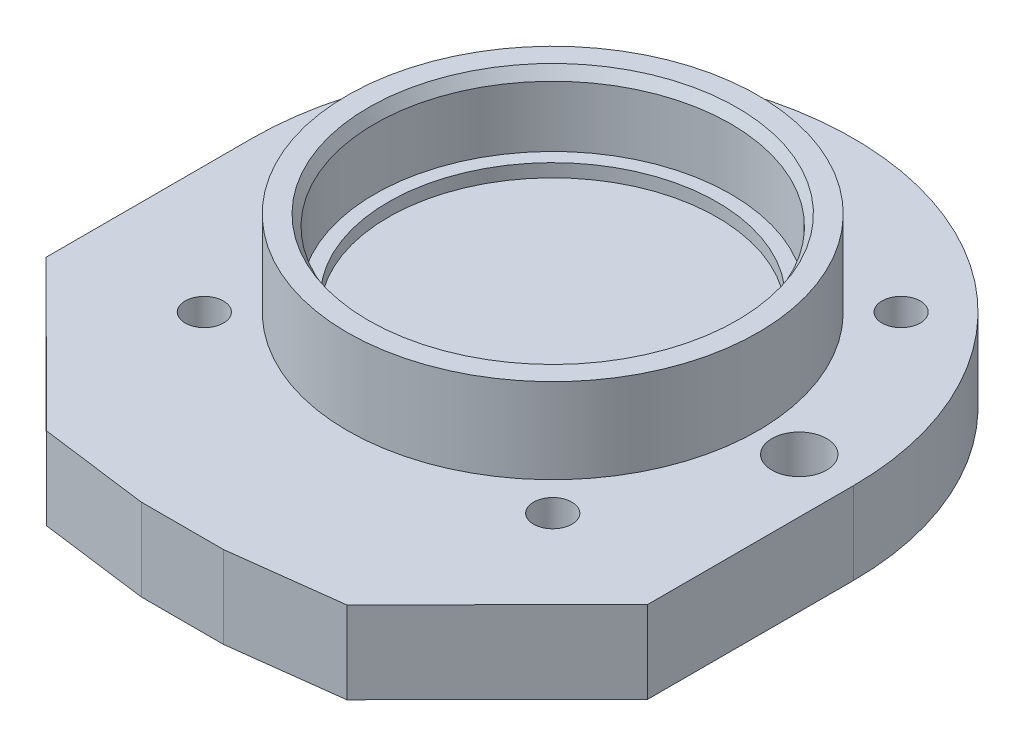
ISO-10303-21;
HEADER;
FILE_DESCRIPTION(('STEP AP214'),'2;1');
FILE_NAME('part.step','',(''),(''),'','','');
FILE_SCHEMA(('AUTOMOTIVE_DESIGN { 1 0 10303 214 1 1 1 1 }'));
ENDSEC;
DATA;
#1=APPLICATION_CONTEXT('core data for automotive mechanical design processes');
#2=APPLICATION_PROTOCOL_DEFINITION('international standard','automotive_design',2000,#1);
#3=PRODUCT_CONTEXT('',#1,'mechanical');
#4=PRODUCT('Part','Part','',(#3));
#5=PRODUCT_RELATED_PRODUCT_CATEGORY('part','',(#4));
#6=PRODUCT_DEFINITION_FORMATION('','',#4);
#7=PRODUCT_DEFINITION_CONTEXT('part definition',#1,'design');
#8=PRODUCT_DEFINITION('design','',#6,#7);
#9=PRODUCT_DEFINITION_SHAPE('','',#8);
#10=(LENGTH_UNIT() NAMED_UNIT(*) SI_UNIT(.MILLI.,.METRE.));
#11=(NAMED_UNIT(*) PLANE_ANGLE_UNIT() SI_UNIT($,.RADIAN.));
#12=(NAMED_UNIT(*) SI_UNIT($,.STERADIAN.) SOLID_ANGLE_UNIT());
#13=UNCERTAINTY_MEASURE_WITH_UNIT(LENGTH_MEASURE(1.E-05),#10,'distance_accuracy_value','');
#14=(GEOMETRIC_REPRESENTATION_CONTEXT(3) GLOBAL_UNCERTAINTY_ASSIGNED_CONTEXT((#13)) GLOBAL_UNIT_ASSIGNED_CONTEXT((#10,
#11,#12)) REPRESENTATION_CONTEXT('',''));
#15=CARTESIAN_POINT('',(0.,0.,0.));
#16=DIRECTION('',(0.,0.,1.));
#17=DIRECTION('',(1.,0.,0.));
#18=AXIS2_PLACEMENT_3D('',#15,#16,#17);
#19=CARTESIAN_POINT('',(0.,30.,0.));
#20=DIRECTION('',(0.,1.,0.));
#21=DIRECTION('',(0.,0.,1.00000000000001));
#22=AXIS2_PLACEMENT_3D('',#19,#20,#21);
#23=PLANE('',#22);
#24=CARTESIAN_POINT('',(0.,30.,0.));
#25=DIRECTION('',(0.,1.,0.));
#26=DIRECTION('',(0.,0.,1.00000000000001));
#27=AXIS2_PLACEMENT_3D('',#24,#25,#26);
#28=CIRCLE('',#27,60.);
#29=CARTESIAN_POINT('',(0.,30.,60.0000000000004));
#30=VERTEX_POINT('',#29);
#31=EDGE_CURVE('E19',#30,#30,#28,.T.);
#32=ORIENTED_EDGE('',*,*,#31,.T.);
#33=EDGE_LOOP('',(#32));
#34=FACE_BOUND('',#33,.T.);
#35=ADVANCED_FACE('F16',(#34),#23,.T.);
#36=CARTESIAN_POINT('',(0.,34.8,0.));
#37=DIRECTION('',(0.,1.,0.));
#38=DIRECTION('',(0.,0.,1.00000000000001));
#39=AXIS2_PLACEMENT_3D('',#36,#37,#38);
#40=CYLINDRICAL_SURFACE('',#39,60.);
#41=ORIENTED_EDGE('',*,*,#31,.F.);
#42=EDGE_LOOP('',(#41));
#43=FACE_BOUND('',#42,.T.);
#44=CARTESIAN_POINT('',(0.,34.8,0.));
#45=DIRECTION('',(0.,1.,0.));
#46=DIRECTION('',(0.,0.,1.00000000000001));
#47=AXIS2_PLACEMENT_3D('',#44,#45,#46);
#48=CIRCLE('',#47,60.);
#49=CARTESIAN_POINT('',(0.,34.8,60.0000000000004));
#50=VERTEX_POINT('',#49);
#51=EDGE_CURVE('E204',#50,#50,#48,.F.);
#52=ORIENTED_EDGE('',*,*,#51,.F.);
#53=EDGE_LOOP('',(#52));
#54=FACE_BOUND('',#53,.T.);
#55=ADVANCED_FACE('F212',(#43,#54),#40,.F.);
#56=CARTESIAN_POINT('',(0.,34.8,0.));
#57=DIRECTION('',(0.,1.,0.));
#58=DIRECTION('',(0.,0.,1.00000000000001));
#59=AXIS2_PLACEMENT_3D('',#56,#57,#58);
#60=PLANE('',#59);
#61=ORIENTED_EDGE('',*,*,#51,.T.);
#62=EDGE_LOOP('',(#61));
#63=FACE_BOUND('',#62,.T.);
#64=CARTESIAN_POINT('',(0.,34.8,0.));
#65=DIRECTION('',(0.,1.,0.));
#66=DIRECTION('',(0.,0.,1.00000000000001));
#67=AXIS2_PLACEMENT_3D('',#64,#65,#66);
#68=CIRCLE('',#67,65.);
#69=CARTESIAN_POINT('',(0.,34.8,65.0000000000005));
#70=VERTEX_POINT('',#69);
#71=EDGE_CURVE('E202',#70,#70,#68,.T.);
#72=ORIENTED_EDGE('',*,*,#71,.T.);
#73=EDGE_LOOP('',(#72));
#74=FACE_BOUND('',#73,.T.);
#75=ADVANCED_FACE('F215',(#63,#74),#60,.T.);
#76=CARTESIAN_POINT('',(0.,61.,0.));
#77=DIRECTION('',(0.,1.,0.));
#78=DIRECTION('',(0.,0.,1.00000000000001));
#79=AXIS2_PLACEMENT_3D('',#76,#77,#78);
#80=CYLINDRICAL_SURFACE('',#79,65.);
#81=ORIENTED_EDGE('',*,*,#71,.F.);
#82=EDGE_LOOP('',(#81));
#83=FACE_BOUND('',#82,.T.);
#84=CARTESIAN_POINT('',(4.9960036108132E-13,56.999925434073,0.));
#85=DIRECTION('',(0.,1.,0.));
#86=DIRECTION('',(0.,0.,1.00000000000001));
#87=AXIS2_PLACEMENT_3D('',#84,#85,#86);
#88=CIRCLE('',#87,65.);
#89=CARTESIAN_POINT('',(4.99663786908411E-13,56.999925434073,65.0000000000004));
#90=VERTEX_POINT('',#89);
#91=EDGE_CURVE('E199',#90,#90,#88,.T.);
#92=ORIENTED_EDGE('',*,*,#91,.T.);
#93=EDGE_LOOP('',(#92));
#94=FACE_BOUND('',#93,.T.);
#95=ADVANCED_FACE('F221',(#83,#94),#80,.F.);
#96=CARTESIAN_POINT('',(4.9960036108132E-13,60.9999806962001,0.));
#97=DIRECTION('',(0.,1.,0.));
#98=DIRECTION('',(0.,0.,1.00000000000001));
#99=AXIS2_PLACEMENT_3D('',#96,#97,#98);
#100=CONICAL_SURFACE('',#99,67.3094345119396,0.523599062390001);
#101=ORIENTED_EDGE('',*,*,#91,.F.);
#102=EDGE_LOOP('',(#101));
#103=FACE_BOUND('',#102,.T.);
#104=CARTESIAN_POINT('',(4.9960036108132E-13,61.,0.));
#105=DIRECTION('',(0.,1.,0.));
#106=DIRECTION('',(0.,0.,1.00000000000001));
#107=AXIS2_PLACEMENT_3D('',#104,#105,#106);
#108=CIRCLE('',#107,67.309445657001);
#109=CARTESIAN_POINT('',(4.99666040423809E-13,61.,67.3094456570014));
#110=VERTEX_POINT('',#109);
#111=EDGE_CURVE('E196',#110,#110,#108,.F.);
#112=ORIENTED_EDGE('',*,*,#111,.F.);
#113=EDGE_LOOP('',(#112));
#114=FACE_BOUND('',#113,.T.);
#115=ADVANCED_FACE('F321',(#103,#114),#100,.F.);
#116=CARTESIAN_POINT('',(0.,61.,0.));
#117=DIRECTION('',(0.,1.,0.));
#118=DIRECTION('',(0.,0.,1.00000000000001));
#119=AXIS2_PLACEMENT_3D('',#116,#117,#118);
#120=PLANE('',#119);
#121=ORIENTED_EDGE('',*,*,#111,.T.);
#122=EDGE_LOOP('',(#121));
#123=FACE_BOUND('',#122,.T.);
#124=CARTESIAN_POINT('',(0.,61.,0.));
#125=DIRECTION('',(0.,1.,0.));
#126=DIRECTION('',(0.,0.,1.00000000000001));
#127=AXIS2_PLACEMENT_3D('',#124,#125,#126);
#128=CIRCLE('',#127,75.);
#129=CARTESIAN_POINT('',(0.,61.,75.0000000000006));
#130=VERTEX_POINT('',#129);
#131=EDGE_CURVE('E193',#130,#130,#128,.F.);
#132=ORIENTED_EDGE('',*,*,#131,.F.);
#133=EDGE_LOOP('',(#132));
#134=FACE_BOUND('',#133,.T.);
#135=ADVANCED_FACE('F317',(#123,#134),#120,.T.);
#136=CARTESIAN_POINT('',(0.,30.,0.));
#137=DIRECTION('',(0.,1.,0.));
#138=DIRECTION('',(0.,0.,1.00000000000001));
#139=AXIS2_PLACEMENT_3D('',#136,#137,#138);
#140=CYLINDRICAL_SURFACE('',#139,75.);
#141=ORIENTED_EDGE('',*,*,#131,.T.);
#142=EDGE_LOOP('',(#141));
#143=FACE_BOUND('',#142,.T.);
#144=CARTESIAN_POINT('',(0.,30.,0.));
#145=DIRECTION('',(0.,1.,0.));
#146=DIRECTION('',(0.,0.,1.00000000000001));
#147=AXIS2_PLACEMENT_3D('',#144,#145,#146);
#148=CIRCLE('',#147,75.);
#149=CARTESIAN_POINT('',(0.,30.,75.0000000000006));
#150=VERTEX_POINT('',#149);
#151=EDGE_CURVE('E178',#150,#150,#148,.F.);
#152=ORIENTED_EDGE('',*,*,#151,.F.);
#153=EDGE_LOOP('',(#152));
#154=FACE_BOUND('',#153,.T.);
#155=ADVANCED_FACE('F313',(#143,#154),#140,.T.);
#156=CARTESIAN_POINT('',(-63.5999999999999,16.,-63.5999999999997));
#157=DIRECTION('',(0.,-1.,0.));
#158=DIRECTION('',(0.,0.,-1.00000000000001));
#159=AXIS2_PLACEMENT_3D('',#156,#157,#158);
#160=CYLINDRICAL_SURFACE('',#159,7.);
#161=CARTESIAN_POINT('',(-63.5999999999999,16.,-63.5999999999997));
#162=DIRECTION('',(0.,-1.,0.));
#163=DIRECTION('',(0.,0.,-1.00000000000001));
#164=AXIS2_PLACEMENT_3D('',#161,#162,#163);
#165=CIRCLE('',#164,7.);
#166=CARTESIAN_POINT('',(-63.5999999999999,16.,-70.5999999999998));
#167=VERTEX_POINT('',#166);
#168=EDGE_CURVE('E190',#167,#167,#165,.F.);
#169=ORIENTED_EDGE('',*,*,#168,.F.);
#170=EDGE_LOOP('',(#169));
#171=FACE_BOUND('',#170,.T.);
#172=CARTESIAN_POINT('',(-63.5999999999999,30.,-63.5999999999997));
#173=DIRECTION('',(0.,-1.,0.));
#174=DIRECTION('',(0.,0.,-1.00000000000001));
#175=AXIS2_PLACEMENT_3D('',#172,#173,#174);
#176=CIRCLE('',#175,7.);
#177=CARTESIAN_POINT('',(-63.5999999999999,30.,-70.5999999999998));
#178=VERTEX_POINT('',#177);
#179=EDGE_CURVE('E175',#178,#178,#176,.T.);
#180=ORIENTED_EDGE('',*,*,#179,.F.);
#181=EDGE_LOOP('',(#180));
#182=FACE_BOUND('',#181,.T.);
#183=ADVANCED_FACE('F309',(#171,#182),#160,.F.);
#184=CARTESIAN_POINT('',(-63.5999999999999,16.,63.6));
#185=DIRECTION('',(0.,-1.,0.));
#186=DIRECTION('',(0.,0.,-1.00000000000001));
#187=AXIS2_PLACEMENT_3D('',#184,#185,#186);
#188=CYLINDRICAL_SURFACE('',#187,7.);
#189=CARTESIAN_POINT('',(-63.5999999999999,16.,63.6));
#190=DIRECTION('',(0.,-1.,0.));
#191=DIRECTION('',(0.,0.,-1.00000000000001));
#192=AXIS2_PLACEMENT_3D('',#189,#190,#191);
#193=CIRCLE('',#192,7.);
#194=CARTESIAN_POINT('',(-63.5999999999999,16.,56.5999999999999));
#195=VERTEX_POINT('',#194);
#196=EDGE_CURVE('E187',#195,#195,#193,.F.);
#197=ORIENTED_EDGE('',*,*,#196,.F.);
#198=EDGE_LOOP('',(#197));
#199=FACE_BOUND('',#198,.T.);
#200=CARTESIAN_POINT('',(-63.5999999999999,30.,63.6));
#201=DIRECTION('',(0.,-1.,0.));
#202=DIRECTION('',(0.,0.,-1.00000000000001));
#203=AXIS2_PLACEMENT_3D('',#200,#201,#202);
#204=CIRCLE('',#203,7.);
#205=CARTESIAN_POINT('',(-63.5999999999999,30.,56.5999999999999));
#206=VERTEX_POINT('',#205);
#207=EDGE_CURVE('E172',#206,#206,#204,.T.);
#208=ORIENTED_EDGE('',*,*,#207,.F.);
#209=EDGE_LOOP('',(#208));
#210=FACE_BOUND('',#209,.T.);
#211=ADVANCED_FACE('F305',(#199,#210),#188,.F.);
#212=CARTESIAN_POINT('',(63.5999999999999,16.,63.5999999999995));
#213=DIRECTION('',(0.,-1.,0.));
#214=DIRECTION('',(0.,0.,-1.00000000000001));
#215=AXIS2_PLACEMENT_3D('',#212,#213,#214);
#216=CYLINDRICAL_SURFACE('',#215,7.);
#217=CARTESIAN_POINT('',(63.5999999999999,16.,63.5999999999995));
#218=DIRECTION('',(0.,-1.,0.));
#219=DIRECTION('',(0.,0.,-1.00000000000001));
#220=AXIS2_PLACEMENT_3D('',#217,#218,#219);
#221=CIRCLE('',#220,7.);
#222=CARTESIAN_POINT('',(63.5999999999999,16.,56.5999999999994));
#223=VERTEX_POINT('',#222);
#224=EDGE_CURVE('E184',#223,#223,#221,.F.);
#225=ORIENTED_EDGE('',*,*,#224,.F.);
#226=EDGE_LOOP('',(#225));
#227=FACE_BOUND('',#226,.T.);
#228=CARTESIAN_POINT('',(63.5999999999999,30.,63.5999999999995));
#229=DIRECTION('',(0.,-1.,0.));
#230=DIRECTION('',(0.,0.,-1.00000000000001));
#231=AXIS2_PLACEMENT_3D('',#228,#229,#230);
#232=CIRCLE('',#231,7.);
#233=CARTESIAN_POINT('',(63.5999999999999,30.,56.5999999999994));
#234=VERTEX_POINT('',#233);
#235=EDGE_CURVE('E169',#234,#234,#232,.T.);
#236=ORIENTED_EDGE('',*,*,#235,.F.);
#237=EDGE_LOOP('',(#236));
#238=FACE_BOUND('',#237,.T.);
#239=ADVANCED_FACE('F301',(#227,#238),#216,.F.);
#240=CARTESIAN_POINT('',(63.6,16.,-63.6));
#241=DIRECTION('',(0.,-1.,0.));
#242=DIRECTION('',(0.,0.,-1.00000000000001));
#243=AXIS2_PLACEMENT_3D('',#240,#241,#242);
#244=CYLINDRICAL_SURFACE('',#243,7.);
#245=CARTESIAN_POINT('',(63.6,16.,-63.6));
#246=DIRECTION('',(0.,-1.,0.));
#247=DIRECTION('',(0.,0.,-1.00000000000001));
#248=AXIS2_PLACEMENT_3D('',#245,#246,#247);
#249=CIRCLE('',#248,7.);
#250=CARTESIAN_POINT('',(63.6,16.,-70.6));
#251=VERTEX_POINT('',#250);
#252=EDGE_CURVE('E181',#251,#251,#249,.F.);
#253=ORIENTED_EDGE('',*,*,#252,.F.);
#254=EDGE_LOOP('',(#253));
#255=FACE_BOUND('',#254,.T.);
#256=CARTESIAN_POINT('',(63.6,30.,-63.6));
#257=DIRECTION('',(0.,-1.,0.));
#258=DIRECTION('',(0.,0.,-1.00000000000001));
#259=AXIS2_PLACEMENT_3D('',#256,#257,#258);
#260=CIRCLE('',#259,7.);
#261=CARTESIAN_POINT('',(63.6,30.,-70.6));
#262=VERTEX_POINT('',#261);
#263=EDGE_CURVE('E98',#262,#262,#260,.T.);
#264=ORIENTED_EDGE('',*,*,#263,.F.);
#265=EDGE_LOOP('',(#264));
#266=FACE_BOUND('',#265,.T.);
#267=ADVANCED_FACE('F297',(#255,#266),#244,.F.);
#268=CARTESIAN_POINT('',(0.,16.,0.));
#269=DIRECTION('',(0.,-1.,0.));
#270=DIRECTION('',(0.,0.,-1.00000000000001));
#271=AXIS2_PLACEMENT_3D('',#268,#269,#270);
#272=PLANE('',#271);
#273=ORIENTED_EDGE('',*,*,#168,.T.);
#274=EDGE_LOOP('',(#273));
#275=FACE_BOUND('',#274,.T.);
#276=CARTESIAN_POINT('',(-63.5999999999999,16.,-63.5999999999997));
#277=DIRECTION('',(0.,-1.,0.));
#278=DIRECTION('',(0.,0.,-1.00000000000001));
#279=AXIS2_PLACEMENT_3D('',#276,#277,#278);
#280=CIRCLE('',#279,10.);
#281=CARTESIAN_POINT('',(-63.5999999999999,16.,-73.5999999999998));
#282=VERTEX_POINT('',#281);
#283=EDGE_CURVE('E164',#282,#282,#280,.T.);
#284=ORIENTED_EDGE('',*,*,#283,.T.);
#285=EDGE_LOOP('',(#284));
#286=FACE_BOUND('',#285,.T.);
#287=ADVANCED_FACE('F293',(#275,#286),#272,.T.);
#288=CARTESIAN_POINT('',(0.,16.,0.));
#289=DIRECTION('',(0.,-1.,0.));
#290=DIRECTION('',(0.,0.,-1.00000000000001));
#291=AXIS2_PLACEMENT_3D('',#288,#289,#290);
#292=PLANE('',#291);
#293=ORIENTED_EDGE('',*,*,#196,.T.);
#294=EDGE_LOOP('',(#293));
#295=FACE_BOUND('',#294,.T.);
#296=CARTESIAN_POINT('',(-63.5999999999999,16.,63.6));
#297=DIRECTION('',(0.,-1.,0.));
#298=DIRECTION('',(0.,0.,-1.00000000000001));
#299=AXIS2_PLACEMENT_3D('',#296,#297,#298);
#300=CIRCLE('',#299,10.);
#301=CARTESIAN_POINT('',(-63.5999999999999,16.,53.5999999999999));
#302=VERTEX_POINT('',#301);
#303=EDGE_CURVE('E161',#302,#302,#300,.T.);
#304=ORIENTED_EDGE('',*,*,#303,.T.);
#305=EDGE_LOOP('',(#304));
#306=FACE_BOUND('',#305,.T.);
#307=ADVANCED_FACE('F289',(#295,#306),#292,.T.);
#308=CARTESIAN_POINT('',(0.,16.,0.));
#309=DIRECTION('',(0.,-1.,0.));
#310=DIRECTION('',(0.,0.,-1.00000000000001));
#311=AXIS2_PLACEMENT_3D('',#308,#309,#310);
#312=PLANE('',#311);
#313=ORIENTED_EDGE('',*,*,#224,.T.);
#314=EDGE_LOOP('',(#313));
#315=FACE_BOUND('',#314,.T.);
#316=CARTESIAN_POINT('',(63.5999999999999,16.,63.5999999999995));
#317=DIRECTION('',(0.,-1.,0.));
#318=DIRECTION('',(0.,0.,-1.00000000000001));
#319=AXIS2_PLACEMENT_3D('',#316,#317,#318);
#320=CIRCLE('',#319,10.);
#321=CARTESIAN_POINT('',(63.5999999999999,16.,53.5999999999994));
#322=VERTEX_POINT('',#321);
#323=EDGE_CURVE('E158',#322,#322,#320,.T.);
#324=ORIENTED_EDGE('',*,*,#323,.T.);
#325=EDGE_LOOP('',(#324));
#326=FACE_BOUND('',#325,.T.);
#327=ADVANCED_FACE('F285',(#315,#326),#312,.T.);
#328=CARTESIAN_POINT('',(0.,16.,0.));
#329=DIRECTION('',(0.,-1.,0.));
#330=DIRECTION('',(0.,0.,-1.00000000000001));
#331=AXIS2_PLACEMENT_3D('',#328,#329,#330);
#332=PLANE('',#331);
#333=ORIENTED_EDGE('',*,*,#252,.T.);
#334=EDGE_LOOP('',(#333));
#335=FACE_BOUND('',#334,.T.);
#336=CARTESIAN_POINT('',(63.6,16.,-63.6));
#337=DIRECTION('',(0.,-1.,0.));
#338=DIRECTION('',(0.,0.,-1.00000000000001));
#339=AXIS2_PLACEMENT_3D('',#336,#337,#338);
#340=CIRCLE('',#339,10.);
#341=CARTESIAN_POINT('',(63.6,16.,-73.6000000000001));
#342=VERTEX_POINT('',#341);
#343=EDGE_CURVE('E155',#342,#342,#340,.T.);
#344=ORIENTED_EDGE('',*,*,#343,.T.);
#345=EDGE_LOOP('',(#344));
#346=FACE_BOUND('',#345,.T.);
#347=ADVANCED_FACE('F281',(#335,#346),#332,.T.);
#348=CARTESIAN_POINT('',(0.,30.,0.));
#349=DIRECTION('',(0.,1.,0.));
#350=DIRECTION('',(0.,0.,1.00000000000001));
#351=AXIS2_PLACEMENT_3D('',#348,#349,#350);
#352=PLANE('',#351);
#353=CARTESIAN_POINT('',(90.0000000000001,30.,3.05311331771918E-13));
#354=DIRECTION('',(0.,-1.,0.));
#355=DIRECTION('',(0.,0.,-1.00000000000001));
#356=AXIS2_PLACEMENT_3D('',#353,#354,#355);
#357=CIRCLE('',#356,10.);
#358=CARTESIAN_POINT('',(90.0000000000001,30.,-9.99999999999977));
#359=VERTEX_POINT('',#358);
#360=EDGE_CURVE('E152',#359,#359,#357,.T.);
#361=ORIENTED_EDGE('',*,*,#360,.T.);
#362=EDGE_LOOP('',(#361));
#363=FACE_BOUND('',#362,.T.);
#364=ORIENTED_EDGE('',*,*,#263,.T.);
#365=EDGE_LOOP('',(#364));
#366=FACE_BOUND('',#365,.T.);
#367=ORIENTED_EDGE('',*,*,#235,.T.);
#368=EDGE_LOOP('',(#367));
#369=FACE_BOUND('',#368,.T.);
#370=ORIENTED_EDGE('',*,*,#207,.T.);
#371=EDGE_LOOP('',(#370));
#372=FACE_BOUND('',#371,.T.);
#373=ORIENTED_EDGE('',*,*,#179,.T.);
#374=EDGE_LOOP('',(#373));
#375=FACE_BOUND('',#374,.T.);
#376=ORIENTED_EDGE('',*,*,#151,.T.);
#377=EDGE_LOOP('',(#376));
#378=FACE_BOUND('',#377,.T.);
#379=DIRECTION('',(0.,0.,-1.00000000000001));
#380=VECTOR('',#379,1.);
#381=CARTESIAN_POINT('',(109.8,30.,75.2000000000013));
#382=LINE('',#381,#380);
#383=CARTESIAN_POINT('',(109.8,30.,3.33066907387547E-13));
#384=VERTEX_POINT('',#383);
#385=CARTESIAN_POINT('',(109.799999999995,30.,75.1999999999954));
#386=VERTEX_POINT('',#385);
#387=EDGE_CURVE('E94',#384,#386,#382,.F.);
#388=ORIENTED_EDGE('',*,*,#387,.F.);
#389=CARTESIAN_POINT('',(0.,30.,0.));
#390=DIRECTION('',(0.,1.,0.));
#391=DIRECTION('',(0.,0.,1.00000000000001));
#392=AXIS2_PLACEMENT_3D('',#389,#390,#391);
#393=CIRCLE('',#392,109.8);
#394=CARTESIAN_POINT('',(-109.8,30.,0.));
#395=VERTEX_POINT('',#394);
#396=EDGE_CURVE('E88',#395,#384,#393,.F.);
#397=ORIENTED_EDGE('',*,*,#396,.F.);
#398=DIRECTION('',(0.,0.,1.00000000000001));
#399=VECTOR('',#398,1.);
#400=CARTESIAN_POINT('',(-109.8,30.,0.));
#401=LINE('',#400,#399);
#402=CARTESIAN_POINT('',(-109.8,30.,75.2000000000018));
#403=VERTEX_POINT('',#402);
#404=EDGE_CURVE('E78',#403,#395,#401,.F.);
#405=ORIENTED_EDGE('',*,*,#404,.F.);
#406=DIRECTION('',(0.708393596513733,0.,0.705817619798734));
#407=VECTOR('',#406,1.);
#408=CARTESIAN_POINT('',(-109.8,30.,75.2000000000018));
#409=LINE('',#408,#407);
#410=CARTESIAN_POINT('',(-54.7999999999953,30.0000000000001,129.999999999997));
#411=VERTEX_POINT('',#410);
#412=EDGE_CURVE('E103',#411,#403,#409,.F.);
#413=ORIENTED_EDGE('',*,*,#412,.F.);
#414=DIRECTION('',(0.991572603304283,0.,0.129552199427038));
#415=VECTOR('',#414,1.);
#416=CARTESIAN_POINT('',(-54.8000000000006,30.0000000000001,130.000000000001));
#417=LINE('',#416,#415);
#418=CARTESIAN_POINT('',(-15.0000000000006,30.,135.200000000006));
#419=VERTEX_POINT('',#418);
#420=EDGE_CURVE('E130',#419,#411,#417,.F.);
#421=ORIENTED_EDGE('',*,*,#420,.F.);
#422=DIRECTION('',(1.00000000000001,0.,0.));
#423=VECTOR('',#422,1.);
#424=CARTESIAN_POINT('',(-15.,30.,135.200000000002));
#425=LINE('',#424,#423);
#426=CARTESIAN_POINT('',(14.9999999999998,30.,135.200000000002));
#427=VERTEX_POINT('',#426);
#428=EDGE_CURVE('E125',#427,#419,#425,.F.);
#429=ORIENTED_EDGE('',*,*,#428,.F.);
#430=DIRECTION('',(0.992277876713709,0.,-0.124034734588963));
#431=VECTOR('',#430,1.);
#432=CARTESIAN_POINT('',(14.9999999999998,30.,135.200000000002));
#433=LINE('',#432,#431);
#434=CARTESIAN_POINT('',(55.0000000000003,30.0000000000001,130.200000000004));
#435=VERTEX_POINT('',#434);
#436=EDGE_CURVE('E120',#435,#427,#433,.F.);
#437=ORIENTED_EDGE('',*,*,#436,.F.);
#438=DIRECTION('',(0.705817619798734,0.,-0.708393596513733));
#439=VECTOR('',#438,1.);
#440=CARTESIAN_POINT('',(54.9999999999998,30.0000000000001,130.200000000001));
#441=LINE('',#440,#439);
#442=EDGE_CURVE('E110',#386,#435,#441,.F.);
#443=ORIENTED_EDGE('',*,*,#442,.F.);
#444=EDGE_LOOP('',(#388,#397,#405,#413,#421,#429,#437,#443));
#445=FACE_BOUND('',#444,.T.);
#446=ADVANCED_FACE('F92',(#363,#366,#369,#372,#375,#378,#445),#352,.T.);
#447=CARTESIAN_POINT('',(0.,0.,0.));
#448=DIRECTION('',(0.,1.,0.));
#449=DIRECTION('',(0.,0.,1.00000000000001));
#450=AXIS2_PLACEMENT_3D('',#447,#448,#449);
#451=CYLINDRICAL_SURFACE('',#450,109.8);
#452=DIRECTION('',(0.,1.,0.));
#453=VECTOR('',#452,1.);
#454=CARTESIAN_POINT('',(109.8,0.,1.22124532708767E-12));
#455=LINE('',#454,#453);
#456=CARTESIAN_POINT('',(109.8,0.,1.22124532708767E-12));
#457=VERTEX_POINT('',#456);
#458=EDGE_CURVE('E117',#457,#384,#455,.T.);
#459=ORIENTED_EDGE('',*,*,#458,.F.);
#460=CARTESIAN_POINT('',(0.,0.,0.));
#461=DIRECTION('',(0.,1.,0.));
#462=DIRECTION('',(0.,0.,1.00000000000001));
#463=AXIS2_PLACEMENT_3D('',#460,#461,#462);
#464=CIRCLE('',#463,109.8);
#465=CARTESIAN_POINT('',(-109.8,0.,0.));
#466=VERTEX_POINT('',#465);
#467=EDGE_CURVE('E102',#457,#466,#464,.T.);
#468=ORIENTED_EDGE('',*,*,#467,.T.);
#469=DIRECTION('',(0.,1.,0.));
#470=VECTOR('',#469,1.);
#471=CARTESIAN_POINT('',(-109.8,0.,0.));
#472=LINE('',#471,#470);
#473=EDGE_CURVE('E83',#395,#466,#472,.F.);
#474=ORIENTED_EDGE('',*,*,#473,.F.);
#475=ORIENTED_EDGE('',*,*,#396,.T.);
#476=EDGE_LOOP('',(#459,#468,#474,#475));
#477=FACE_BOUND('',#476,.T.);
#478=ADVANCED_FACE('F101',(#477),#451,.T.);
#479=CARTESIAN_POINT('',(-109.8,0.,0.));
#480=DIRECTION('',(-1.00000000000001,0.,0.));
#481=DIRECTION('',(0.,0.,1.00000000000001));
#482=AXIS2_PLACEMENT_3D('',#479,#480,#481);
#483=PLANE('',#482);
#484=ORIENTED_EDGE('',*,*,#473,.T.);
#485=DIRECTION('',(0.,0.,1.00000000000001));
#486=VECTOR('',#485,1.);
#487=CARTESIAN_POINT('',(-109.8,0.,0.));
#488=LINE('',#487,#486);
#489=CARTESIAN_POINT('',(-109.8,0.,75.2000000000018));
#490=VERTEX_POINT('',#489);
#491=EDGE_CURVE('E151',#466,#490,#488,.T.);
#492=ORIENTED_EDGE('',*,*,#491,.T.);
#493=DIRECTION('',(0.,1.,0.));
#494=VECTOR('',#493,1.);
#495=CARTESIAN_POINT('',(-109.8,0.,75.2000000000018));
#496=LINE('',#495,#494);
#497=EDGE_CURVE('E85',#403,#490,#496,.F.);
#498=ORIENTED_EDGE('',*,*,#497,.F.);
#499=ORIENTED_EDGE('',*,*,#404,.T.);
#500=EDGE_LOOP('',(#484,#492,#498,#499));
#501=FACE_BOUND('',#500,.T.);
#502=ADVANCED_FACE('F80',(#501),#483,.T.);
#503=CARTESIAN_POINT('',(-109.8,0.,75.2000000000018));
#504=DIRECTION('',(-0.705817619798734,0.,0.708393596513733));
#505=DIRECTION('',(0.708393596513733,0.,0.705817619798734));
#506=AXIS2_PLACEMENT_3D('',#503,#504,#505);
#507=PLANE('',#506);
#508=ORIENTED_EDGE('',*,*,#497,.T.);
#509=DIRECTION('',(0.708393596513531,0.,0.70581761979894));
#510=VECTOR('',#509,1.);
#511=CARTESIAN_POINT('',(-109.8,0.,75.2000000000018));
#512=LINE('',#511,#510);
#513=CARTESIAN_POINT('',(-54.8000000000006,0.,130.000000000001));
#514=VERTEX_POINT('',#513);
#515=EDGE_CURVE('E505',#490,#514,#512,.T.);
#516=ORIENTED_EDGE('',*,*,#515,.T.);
#517=DIRECTION('',(0.,1.,0.));
#518=VECTOR('',#517,1.);
#519=CARTESIAN_POINT('',(-54.8000000000006,0.,130.000000000001));
#520=LINE('',#519,#518);
#521=EDGE_CURVE('E127',#411,#514,#520,.F.);
#522=ORIENTED_EDGE('',*,*,#521,.F.);
#523=ORIENTED_EDGE('',*,*,#412,.T.);
#524=EDGE_LOOP('',(#508,#516,#522,#523));
#525=FACE_BOUND('',#524,.T.);
#526=ADVANCED_FACE('F270',(#525),#507,.T.);
#527=CARTESIAN_POINT('',(-54.8000000000006,0.,130.000000000001));
#528=DIRECTION('',(-0.129552199427038,0.,0.991572603304283));
#529=DIRECTION('',(0.991572603304283,0.,0.129552199427038));
#530=AXIS2_PLACEMENT_3D('',#527,#528,#529);
#531=PLANE('',#530);
#532=ORIENTED_EDGE('',*,*,#521,.T.);
#533=DIRECTION('',(0.991572603304331,0.,0.129552199426696));
#534=VECTOR('',#533,1.);
#535=CARTESIAN_POINT('',(-54.8000000000006,0.,130.000000000001));
#536=LINE('',#535,#534);
#537=CARTESIAN_POINT('',(-15.,0.,135.200000000002));
#538=VERTEX_POINT('',#537);
#539=EDGE_CURVE('E487',#514,#538,#536,.T.);
#540=ORIENTED_EDGE('',*,*,#539,.T.);
#541=DIRECTION('',(0.,1.,0.));
#542=VECTOR('',#541,1.);
#543=CARTESIAN_POINT('',(-15.,0.,135.200000000002));
#544=LINE('',#543,#542);
#545=EDGE_CURVE('E122',#419,#538,#544,.F.);
#546=ORIENTED_EDGE('',*,*,#545,.F.);
#547=ORIENTED_EDGE('',*,*,#420,.T.);
#548=EDGE_LOOP('',(#532,#540,#546,#547));
#549=FACE_BOUND('',#548,.T.);
#550=ADVANCED_FACE('F266',(#549),#531,.T.);
#551=CARTESIAN_POINT('',(-15.,0.,135.200000000002));
#552=DIRECTION('',(0.,0.,1.00000000000001));
#553=DIRECTION('',(1.00000000000001,0.,0.));
#554=AXIS2_PLACEMENT_3D('',#551,#552,#553);
#555=PLANE('',#554);
#556=ORIENTED_EDGE('',*,*,#545,.T.);
#557=DIRECTION('',(1.00000000000001,0.,0.));
#558=VECTOR('',#557,1.);
#559=CARTESIAN_POINT('',(-1.66533453693773E-13,0.,135.200000000003));
#560=LINE('',#559,#558);
#561=CARTESIAN_POINT('',(14.9999999999998,0.,135.200000000002));
#562=VERTEX_POINT('',#561);
#563=EDGE_CURVE('E485',#538,#562,#560,.T.);
#564=ORIENTED_EDGE('',*,*,#563,.T.);
#565=DIRECTION('',(0.,1.,0.));
#566=VECTOR('',#565,1.);
#567=CARTESIAN_POINT('',(14.9999999999998,0.,135.200000000002));
#568=LINE('',#567,#566);
#569=EDGE_CURVE('E113',#427,#562,#568,.F.);
#570=ORIENTED_EDGE('',*,*,#569,.F.);
#571=ORIENTED_EDGE('',*,*,#428,.T.);
#572=EDGE_LOOP('',(#556,#564,#570,#571));
#573=FACE_BOUND('',#572,.T.);
#574=ADVANCED_FACE('F262',(#573),#555,.T.);
#575=CARTESIAN_POINT('',(14.9999999999998,0.,135.200000000002));
#576=DIRECTION('',(0.124034734588963,0.,0.992277876713709));
#577=DIRECTION('',(0.992277876713709,0.,-0.124034734588963));
#578=AXIS2_PLACEMENT_3D('',#575,#576,#577);
#579=PLANE('',#578);
#580=ORIENTED_EDGE('',*,*,#569,.T.);
#581=DIRECTION('',(0.992277876713675,0.,-0.124034734589209));
#582=VECTOR('',#581,1.);
#583=CARTESIAN_POINT('',(14.9999999999998,0.,135.200000000002));
#584=LINE('',#583,#582);
#585=CARTESIAN_POINT('',(54.9999999999998,0.,130.200000000001));
#586=VERTEX_POINT('',#585);
#587=EDGE_CURVE('E480',#562,#586,#584,.T.);
#588=ORIENTED_EDGE('',*,*,#587,.T.);
#589=DIRECTION('',(0.,1.,0.));
#590=VECTOR('',#589,1.);
#591=CARTESIAN_POINT('',(54.9999999999998,0.,130.200000000001));
#592=LINE('',#591,#590);
#593=EDGE_CURVE('E112',#435,#586,#592,.F.);
#594=ORIENTED_EDGE('',*,*,#593,.F.);
#595=ORIENTED_EDGE('',*,*,#436,.T.);
#596=EDGE_LOOP('',(#580,#588,#594,#595));
#597=FACE_BOUND('',#596,.T.);
#598=ADVANCED_FACE('F258',(#597),#579,.T.);
#599=CARTESIAN_POINT('',(54.9999999999998,0.,130.200000000001));
#600=DIRECTION('',(0.708393596513733,0.,0.705817619798734));
#601=DIRECTION('',(0.705817619798734,0.,-0.708393596513733));
#602=AXIS2_PLACEMENT_3D('',#599,#600,#601);
#603=PLANE('',#602);
#604=ORIENTED_EDGE('',*,*,#593,.T.);
#605=DIRECTION('',(0.70581761979894,0.,-0.708393596513531));
#606=VECTOR('',#605,1.);
#607=CARTESIAN_POINT('',(54.9999999999998,0.,130.200000000001));
#608=LINE('',#607,#606);
#609=CARTESIAN_POINT('',(109.8,0.,75.2000000000013));
#610=VERTEX_POINT('',#609);
#611=EDGE_CURVE('E477',#586,#610,#608,.T.);
#612=ORIENTED_EDGE('',*,*,#611,.T.);
#613=DIRECTION('',(0.,1.,0.));
#614=VECTOR('',#613,1.);
#615=CARTESIAN_POINT('',(109.8,0.,75.2000000000013));
#616=LINE('',#615,#614);
#617=EDGE_CURVE('E34',#386,#610,#616,.F.);
#618=ORIENTED_EDGE('',*,*,#617,.F.);
#619=ORIENTED_EDGE('',*,*,#442,.T.);
#620=EDGE_LOOP('',(#604,#612,#618,#619));
#621=FACE_BOUND('',#620,.T.);
#622=ADVANCED_FACE('F255',(#621),#603,.T.);
#623=CARTESIAN_POINT('',(109.8,0.,75.2000000000013));
#624=DIRECTION('',(1.00000000000001,0.,0.));
#625=DIRECTION('',(0.,0.,-1.00000000000001));
#626=AXIS2_PLACEMENT_3D('',#623,#624,#625);
#627=PLANE('',#626);
#628=ORIENTED_EDGE('',*,*,#617,.T.);
#629=DIRECTION('',(0.,0.,1.00000000000001));
#630=VECTOR('',#629,1.);
#631=CARTESIAN_POINT('',(109.8,0.,1.22124532708767E-12));
#632=LINE('',#631,#630);
#633=EDGE_CURVE('E149',#610,#457,#632,.F.);
#634=ORIENTED_EDGE('',*,*,#633,.T.);
#635=ORIENTED_EDGE('',*,*,#458,.T.);
#636=ORIENTED_EDGE('',*,*,#387,.T.);
#637=EDGE_LOOP('',(#628,#634,#635,#636));
#638=FACE_BOUND('',#637,.T.);
#639=ADVANCED_FACE('F251',(#638),#627,.T.);
#640=CARTESIAN_POINT('',(-63.5999999999999,0.,-63.5999999999997));
#641=DIRECTION('',(0.,-1.,0.));
#642=DIRECTION('',(0.,0.,-1.00000000000001));
#643=AXIS2_PLACEMENT_3D('',#640,#641,#642);
#644=CYLINDRICAL_SURFACE('',#643,10.);
#645=ORIENTED_EDGE('',*,*,#283,.F.);
#646=EDGE_LOOP('',(#645));
#647=FACE_BOUND('',#646,.T.);
#648=CARTESIAN_POINT('',(-63.5999999999999,0.,-63.5999999999997));
#649=DIRECTION('',(0.,-1.,0.));
#650=DIRECTION('',(0.,0.,-1.00000000000001));
#651=AXIS2_PLACEMENT_3D('',#648,#649,#650);
#652=CIRCLE('',#651,10.);
#653=CARTESIAN_POINT('',(-63.5999999999999,0.,-73.5999999999998));
#654=VERTEX_POINT('',#653);
#655=EDGE_CURVE('E146',#654,#654,#652,.T.);
#656=ORIENTED_EDGE('',*,*,#655,.T.);
#657=EDGE_LOOP('',(#656));
#658=FACE_BOUND('',#657,.T.);
#659=ADVANCED_FACE('F247',(#647,#658),#644,.F.);
#660=CARTESIAN_POINT('',(-63.5999999999999,0.,63.6));
#661=DIRECTION('',(0.,-1.,0.));
#662=DIRECTION('',(0.,0.,-1.00000000000001));
#663=AXIS2_PLACEMENT_3D('',#660,#661,#662);
#664=CYLINDRICAL_SURFACE('',#663,10.);
#665=ORIENTED_EDGE('',*,*,#303,.F.);
#666=EDGE_LOOP('',(#665));
#667=FACE_BOUND('',#666,.T.);
#668=CARTESIAN_POINT('',(-63.5999999999999,0.,63.6));
#669=DIRECTION('',(0.,-1.,0.));
#670=DIRECTION('',(0.,0.,-1.00000000000001));
#671=AXIS2_PLACEMENT_3D('',#668,#669,#670);
#672=CIRCLE('',#671,10.);
#673=CARTESIAN_POINT('',(-63.5999999999999,0.,53.5999999999999));
#674=VERTEX_POINT('',#673);
#675=EDGE_CURVE('E143',#674,#674,#672,.T.);
#676=ORIENTED_EDGE('',*,*,#675,.T.);
#677=EDGE_LOOP('',(#676));
#678=FACE_BOUND('',#677,.T.);
#679=ADVANCED_FACE('F243',(#667,#678),#664,.F.);
#680=CARTESIAN_POINT('',(63.5999999999999,0.,63.6));
#681=DIRECTION('',(0.,-1.,0.));
#682=DIRECTION('',(0.,0.,-1.00000000000001));
#683=AXIS2_PLACEMENT_3D('',#680,#681,#682);
#684=CYLINDRICAL_SURFACE('',#683,10.);
#685=ORIENTED_EDGE('',*,*,#323,.F.);
#686=EDGE_LOOP('',(#685));
#687=FACE_BOUND('',#686,.T.);
#688=CARTESIAN_POINT('',(63.5999999999999,0.,63.6));
#689=DIRECTION('',(0.,-1.,0.));
#690=DIRECTION('',(0.,0.,-1.00000000000001));
#691=AXIS2_PLACEMENT_3D('',#688,#689,#690);
#692=CIRCLE('',#691,10.);
#693=CARTESIAN_POINT('',(63.5999999999999,0.,53.5999999999999));
#694=VERTEX_POINT('',#693);
#695=EDGE_CURVE('E140',#694,#694,#692,.T.);
#696=ORIENTED_EDGE('',*,*,#695,.T.);
#697=EDGE_LOOP('',(#696));
#698=FACE_BOUND('',#697,.T.);
#699=ADVANCED_FACE('F239',(#687,#698),#684,.F.);
#700=CARTESIAN_POINT('',(63.6,0.,-63.5999999999997));
#701=DIRECTION('',(0.,-1.,0.));
#702=DIRECTION('',(0.,0.,-1.00000000000001));
#703=AXIS2_PLACEMENT_3D('',#700,#701,#702);
#704=CYLINDRICAL_SURFACE('',#703,10.);
#705=ORIENTED_EDGE('',*,*,#343,.F.);
#706=EDGE_LOOP('',(#705));
#707=FACE_BOUND('',#706,.T.);
#708=CARTESIAN_POINT('',(63.6,0.,-63.5999999999997));
#709=DIRECTION('',(0.,-1.,0.));
#710=DIRECTION('',(0.,0.,-1.00000000000001));
#711=AXIS2_PLACEMENT_3D('',#708,#709,#710);
#712=CIRCLE('',#711,10.);
#713=CARTESIAN_POINT('',(63.6,0.,-73.5999999999998));
#714=VERTEX_POINT('',#713);
#715=EDGE_CURVE('E25',#714,#714,#712,.T.);
#716=ORIENTED_EDGE('',*,*,#715,.T.);
#717=EDGE_LOOP('',(#716));
#718=FACE_BOUND('',#717,.T.);
#719=ADVANCED_FACE('F231',(#707,#718),#704,.F.);
#720=CARTESIAN_POINT('',(90.0000000000001,0.,1.22124532708767E-12));
#721=DIRECTION('',(0.,-1.,0.));
#722=DIRECTION('',(0.,0.,-1.00000000000001));
#723=AXIS2_PLACEMENT_3D('',#720,#721,#722);
#724=CYLINDRICAL_SURFACE('',#723,10.);
#725=ORIENTED_EDGE('',*,*,#360,.F.);
#726=EDGE_LOOP('',(#725));
#727=FACE_BOUND('',#726,.T.);
#728=CARTESIAN_POINT('',(90.0000000000001,0.,1.22124532708767E-12));
#729=DIRECTION('',(0.,-1.,0.));
#730=DIRECTION('',(0.,0.,-1.00000000000001));
#731=AXIS2_PLACEMENT_3D('',#728,#729,#730);
#732=CIRCLE('',#731,10.);
#733=CARTESIAN_POINT('',(90.0000000000001,0.,-9.99999999999885));
#734=VERTEX_POINT('',#733);
#735=EDGE_CURVE('E11',#734,#734,#732,.T.);
#736=ORIENTED_EDGE('',*,*,#735,.T.);
#737=EDGE_LOOP('',(#736));
#738=FACE_BOUND('',#737,.T.);
#739=ADVANCED_FACE('F225',(#727,#738),#724,.F.);
#740=CARTESIAN_POINT('',(0.,0.,0.));
#741=DIRECTION('',(0.,1.,0.));
#742=DIRECTION('',(0.,0.,1.00000000000001));
#743=AXIS2_PLACEMENT_3D('',#740,#741,#742);
#744=PLANE('',#743);
#745=ORIENTED_EDGE('',*,*,#735,.F.);
#746=EDGE_LOOP('',(#745));
#747=FACE_BOUND('',#746,.T.);
#748=ORIENTED_EDGE('',*,*,#715,.F.);
#749=EDGE_LOOP('',(#748));
#750=FACE_BOUND('',#749,.T.);
#751=ORIENTED_EDGE('',*,*,#695,.F.);
#752=EDGE_LOOP('',(#751));
#753=FACE_BOUND('',#752,.T.);
#754=ORIENTED_EDGE('',*,*,#675,.F.);
#755=EDGE_LOOP('',(#754));
#756=FACE_BOUND('',#755,.T.);
#757=ORIENTED_EDGE('',*,*,#655,.F.);
#758=EDGE_LOOP('',(#757));
#759=FACE_BOUND('',#758,.T.);
#760=ORIENTED_EDGE('',*,*,#611,.F.);
#761=ORIENTED_EDGE('',*,*,#587,.F.);
#762=ORIENTED_EDGE('',*,*,#563,.F.);
#763=ORIENTED_EDGE('',*,*,#539,.F.);
#764=ORIENTED_EDGE('',*,*,#515,.F.);
#765=ORIENTED_EDGE('',*,*,#491,.F.);
#766=ORIENTED_EDGE('',*,*,#467,.F.);
#767=ORIENTED_EDGE('',*,*,#633,.F.);
#768=EDGE_LOOP('',(#760,#761,#762,#763,#764,#765,#766,#767));
#769=FACE_BOUND('',#768,.T.);
#770=ADVANCED_FACE('F223',(#747,#750,#753,#756,#759,#769),#744,.F.);
#771=CLOSED_SHELL('',(#35,#55,#75,#95,#115,#135,#155,#183,#211,#239,#267,#287,#307,#327,#347,
#446,#478,#502,#526,#550,#574,#598,#622,#639,#659,#679,#699,#719,#739,#770));
#772=MANIFOLD_SOLID_BREP('B1',#771);
#773=ADVANCED_BREP_SHAPE_REPRESENTATION('',(#18,#772),#14);
#774=SHAPE_DEFINITION_REPRESENTATION(#9,#773);
ENDSEC;
END-ISO-10303-21;
